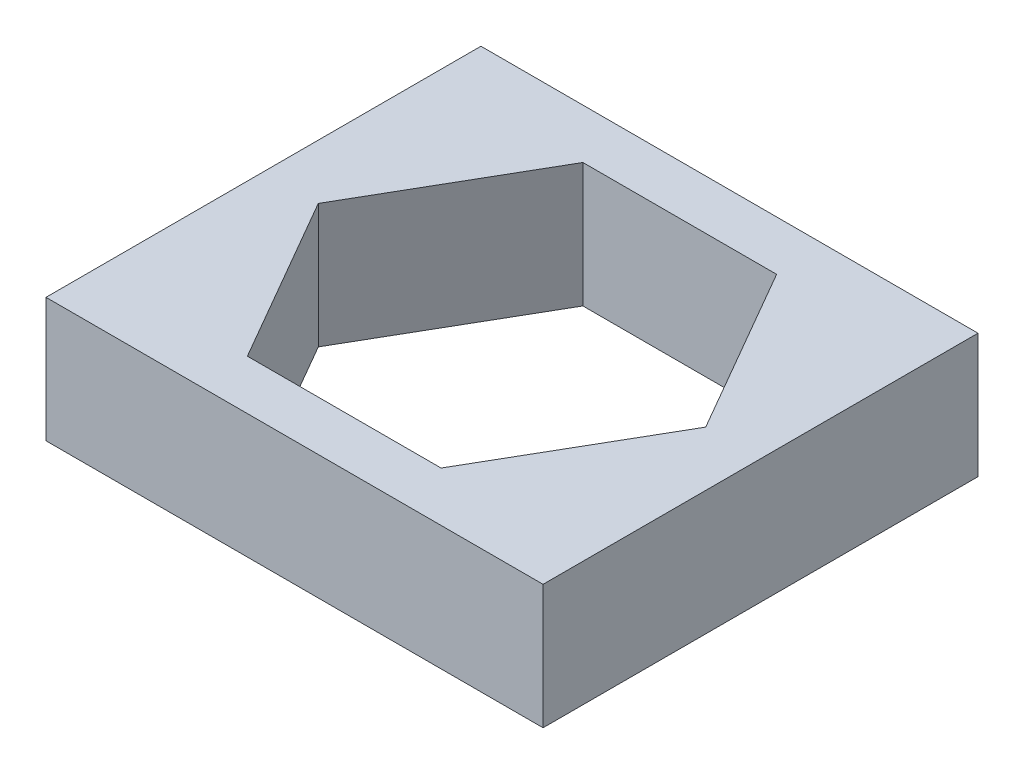
ISO-10303-21;
HEADER;
FILE_DESCRIPTION(('STEP AP214'),'2;1');
FILE_NAME('part.step','',(''),(''),'','','');
FILE_SCHEMA(('AUTOMOTIVE_DESIGN { 1 0 10303 214 1 1 1 1 }'));
ENDSEC;
DATA;
#1=APPLICATION_CONTEXT('core data for automotive mechanical design processes');
#2=APPLICATION_PROTOCOL_DEFINITION('international standard','automotive_design',2000,#1);
#3=PRODUCT_CONTEXT('',#1,'mechanical');
#4=PRODUCT('Part','Part','',(#3));
#5=PRODUCT_RELATED_PRODUCT_CATEGORY('part','',(#4));
#6=PRODUCT_DEFINITION_FORMATION('','',#4);
#7=PRODUCT_DEFINITION_CONTEXT('part definition',#1,'design');
#8=PRODUCT_DEFINITION('design','',#6,#7);
#9=PRODUCT_DEFINITION_SHAPE('','',#8);
#10=(LENGTH_UNIT() NAMED_UNIT(*) SI_UNIT(.MILLI.,.METRE.));
#11=(NAMED_UNIT(*) PLANE_ANGLE_UNIT() SI_UNIT($,.RADIAN.));
#12=(NAMED_UNIT(*) SI_UNIT($,.STERADIAN.) SOLID_ANGLE_UNIT());
#13=UNCERTAINTY_MEASURE_WITH_UNIT(LENGTH_MEASURE(1.E-05),#10,'distance_accuracy_value','');
#14=(GEOMETRIC_REPRESENTATION_CONTEXT(3) GLOBAL_UNCERTAINTY_ASSIGNED_CONTEXT((#13)) GLOBAL_UNIT_ASSIGNED_CONTEXT((#10,
#11,#12)) REPRESENTATION_CONTEXT('',''));
#15=CARTESIAN_POINT('',(0.,0.,0.));
#16=DIRECTION('',(0.,0.,1.));
#17=DIRECTION('',(1.,0.,0.));
#18=AXIS2_PLACEMENT_3D('',#15,#16,#17);
#19=CARTESIAN_POINT('',(0.,2.,0.));
#20=DIRECTION('',(0.,-1.,0.));
#21=DIRECTION('',(0.,0.,-1.));
#22=AXIS2_PLACEMENT_3D('',#19,#20,#21);
#23=PLANE('',#22);
#24=DIRECTION('',(0.,0.,1.));
#25=VECTOR('',#24,1.);
#26=CARTESIAN_POINT('',(0.,2.,0.));
#27=LINE('',#26,#25);
#28=CARTESIAN_POINT('',(0.,2.,-7.));
#29=VERTEX_POINT('',#28);
#30=CARTESIAN_POINT('',(0.,2.,0.));
#31=VERTEX_POINT('',#30);
#32=EDGE_CURVE('E171',#29,#31,#27,.T.);
#33=ORIENTED_EDGE('',*,*,#32,.T.);
#34=DIRECTION('',(1.,0.,0.));
#35=VECTOR('',#34,1.);
#36=CARTESIAN_POINT('',(0.,2.,0.));
#37=LINE('',#36,#35);
#38=CARTESIAN_POINT('',(8.,2.,0.));
#39=VERTEX_POINT('',#38);
#40=EDGE_CURVE('E174',#31,#39,#37,.T.);
#41=ORIENTED_EDGE('',*,*,#40,.T.);
#42=DIRECTION('',(0.,0.,-1.));
#43=VECTOR('',#42,1.);
#44=CARTESIAN_POINT('',(8.,2.,0.));
#45=LINE('',#44,#43);
#46=CARTESIAN_POINT('',(8.,2.,-7.));
#47=VERTEX_POINT('',#46);
#48=EDGE_CURVE('E177',#39,#47,#45,.T.);
#49=ORIENTED_EDGE('',*,*,#48,.T.);
#50=DIRECTION('',(-1.,0.,0.));
#51=VECTOR('',#50,1.);
#52=CARTESIAN_POINT('',(0.,2.,-7.));
#53=LINE('',#52,#51);
#54=EDGE_CURVE('E179',#47,#29,#53,.T.);
#55=ORIENTED_EDGE('',*,*,#54,.T.);
#56=EDGE_LOOP('',(#33,#41,#49,#55));
#57=FACE_BOUND('',#56,.T.);
#58=DIRECTION('',(0.5,0.,-0.866025403784439));
#59=VECTOR('',#58,1.);
#60=CARTESIAN_POINT('',(5.55884572681199,2.,-0.799999999999994));
#61=LINE('',#60,#59);
#62=CARTESIAN_POINT('',(5.55884572681199,2.,-0.799999999999994));
#63=VERTEX_POINT('',#62);
#64=CARTESIAN_POINT('',(7.11769145362398,2.,-3.5));
#65=VERTEX_POINT('',#64);
#66=EDGE_CURVE('E120',#63,#65,#61,.T.);
#67=ORIENTED_EDGE('',*,*,#66,.F.);
#68=DIRECTION('',(1.,0.,0.));
#69=VECTOR('',#68,1.);
#70=CARTESIAN_POINT('',(2.44115427318801,2.,-0.799999999999995));
#71=LINE('',#70,#69);
#72=CARTESIAN_POINT('',(2.44115427318801,2.,-0.799999999999995));
#73=VERTEX_POINT('',#72);
#74=EDGE_CURVE('E149',#73,#63,#71,.T.);
#75=ORIENTED_EDGE('',*,*,#74,.F.);
#76=DIRECTION('',(0.5,0.,0.866025403784438));
#77=VECTOR('',#76,1.);
#78=CARTESIAN_POINT('',(0.882308546376014,2.,-3.5));
#79=LINE('',#78,#77);
#80=CARTESIAN_POINT('',(0.882308546376014,2.,-3.5));
#81=VERTEX_POINT('',#80);
#82=EDGE_CURVE('E147',#81,#73,#79,.T.);
#83=ORIENTED_EDGE('',*,*,#82,.F.);
#84=DIRECTION('',(-0.5,0.,0.866025403784439));
#85=VECTOR('',#84,1.);
#86=CARTESIAN_POINT('',(2.44115427318801,2.,-6.20000000000001));
#87=LINE('',#86,#85);
#88=CARTESIAN_POINT('',(2.44115427318801,2.,-6.20000000000001));
#89=VERTEX_POINT('',#88);
#90=EDGE_CURVE('E143',#89,#81,#87,.T.);
#91=ORIENTED_EDGE('',*,*,#90,.F.);
#92=DIRECTION('',(-1.,0.,0.));
#93=VECTOR('',#92,1.);
#94=CARTESIAN_POINT('',(5.55884572681199,2.,-6.20000000000001));
#95=LINE('',#94,#93);
#96=CARTESIAN_POINT('',(5.55884572681199,2.,-6.20000000000001));
#97=VERTEX_POINT('',#96);
#98=EDGE_CURVE('E141',#97,#89,#95,.T.);
#99=ORIENTED_EDGE('',*,*,#98,.F.);
#100=DIRECTION('',(-0.5,0.,-0.866025403784439));
#101=VECTOR('',#100,1.);
#102=CARTESIAN_POINT('',(7.11769145362398,2.,-3.5));
#103=LINE('',#102,#101);
#104=EDGE_CURVE('E128',#65,#97,#103,.T.);
#105=ORIENTED_EDGE('',*,*,#104,.F.);
#106=EDGE_LOOP('',(#67,#75,#83,#91,#99,#105));
#107=FACE_BOUND('',#106,.T.);
#108=ADVANCED_FACE('F43',(#57,#107),#23,.F.);
#109=CARTESIAN_POINT('',(0.,0.,0.));
#110=DIRECTION('',(0.,-1.,0.));
#111=DIRECTION('',(0.,0.,-1.));
#112=AXIS2_PLACEMENT_3D('',#109,#110,#111);
#113=PLANE('',#112);
#114=DIRECTION('',(0.,0.,1.));
#115=VECTOR('',#114,1.);
#116=CARTESIAN_POINT('',(0.,0.,0.));
#117=LINE('',#116,#115);
#118=CARTESIAN_POINT('',(0.,0.,-7.));
#119=VERTEX_POINT('',#118);
#120=CARTESIAN_POINT('',(0.,0.,0.));
#121=VERTEX_POINT('',#120);
#122=EDGE_CURVE('E136',#119,#121,#117,.T.);
#123=ORIENTED_EDGE('',*,*,#122,.F.);
#124=DIRECTION('',(-1.,0.,0.));
#125=VECTOR('',#124,1.);
#126=CARTESIAN_POINT('',(0.,0.,-7.));
#127=LINE('',#126,#125);
#128=CARTESIAN_POINT('',(8.,0.,-7.));
#129=VERTEX_POINT('',#128);
#130=EDGE_CURVE('E175',#129,#119,#127,.T.);
#131=ORIENTED_EDGE('',*,*,#130,.F.);
#132=DIRECTION('',(0.,0.,-1.));
#133=VECTOR('',#132,1.);
#134=CARTESIAN_POINT('',(8.,0.,0.));
#135=LINE('',#134,#133);
#136=CARTESIAN_POINT('',(8.,0.,0.));
#137=VERTEX_POINT('',#136);
#138=EDGE_CURVE('E186',#137,#129,#135,.T.);
#139=ORIENTED_EDGE('',*,*,#138,.F.);
#140=DIRECTION('',(1.,0.,0.));
#141=VECTOR('',#140,1.);
#142=CARTESIAN_POINT('',(0.,0.,0.));
#143=LINE('',#142,#141);
#144=EDGE_CURVE('E184',#121,#137,#143,.T.);
#145=ORIENTED_EDGE('',*,*,#144,.F.);
#146=EDGE_LOOP('',(#123,#131,#139,#145));
#147=FACE_BOUND('',#146,.T.);
#148=DIRECTION('',(1.,0.,0.));
#149=VECTOR('',#148,1.);
#150=CARTESIAN_POINT('',(2.44115427318801,0.,-0.799999999999995));
#151=LINE('',#150,#149);
#152=CARTESIAN_POINT('',(2.44115427318801,0.,-0.799999999999995));
#153=VERTEX_POINT('',#152);
#154=CARTESIAN_POINT('',(5.55884572681199,0.,-0.799999999999994));
#155=VERTEX_POINT('',#154);
#156=EDGE_CURVE('E129',#153,#155,#151,.T.);
#157=ORIENTED_EDGE('',*,*,#156,.T.);
#158=DIRECTION('',(0.5,0.,-0.866025403784439));
#159=VECTOR('',#158,1.);
#160=CARTESIAN_POINT('',(5.55884572681199,0.,-0.799999999999994));
#161=LINE('',#160,#159);
#162=CARTESIAN_POINT('',(7.11769145362398,0.,-3.5));
#163=VERTEX_POINT('',#162);
#164=EDGE_CURVE('E66',#155,#163,#161,.T.);
#165=ORIENTED_EDGE('',*,*,#164,.T.);
#166=DIRECTION('',(-0.5,0.,-0.866025403784439));
#167=VECTOR('',#166,1.);
#168=CARTESIAN_POINT('',(7.11769145362398,0.,-3.5));
#169=LINE('',#168,#167);
#170=CARTESIAN_POINT('',(5.55884572681199,0.,-6.20000000000001));
#171=VERTEX_POINT('',#170);
#172=EDGE_CURVE('E135',#163,#171,#169,.T.);
#173=ORIENTED_EDGE('',*,*,#172,.T.);
#174=DIRECTION('',(-1.,0.,0.));
#175=VECTOR('',#174,1.);
#176=CARTESIAN_POINT('',(5.55884572681199,0.,-6.20000000000001));
#177=LINE('',#176,#175);
#178=CARTESIAN_POINT('',(2.44115427318801,0.,-6.20000000000001));
#179=VERTEX_POINT('',#178);
#180=EDGE_CURVE('E153',#171,#179,#177,.T.);
#181=ORIENTED_EDGE('',*,*,#180,.T.);
#182=DIRECTION('',(-0.5,0.,0.866025403784439));
#183=VECTOR('',#182,1.);
#184=CARTESIAN_POINT('',(2.44115427318801,0.,-6.20000000000001));
#185=LINE('',#184,#183);
#186=CARTESIAN_POINT('',(0.882308546376014,0.,-3.5));
#187=VERTEX_POINT('',#186);
#188=EDGE_CURVE('E156',#179,#187,#185,.T.);
#189=ORIENTED_EDGE('',*,*,#188,.T.);
#190=DIRECTION('',(0.5,0.,0.866025403784438));
#191=VECTOR('',#190,1.);
#192=CARTESIAN_POINT('',(0.882308546376014,0.,-3.5));
#193=LINE('',#192,#191);
#194=EDGE_CURVE('E159',#187,#153,#193,.T.);
#195=ORIENTED_EDGE('',*,*,#194,.T.);
#196=EDGE_LOOP('',(#157,#165,#173,#181,#189,#195));
#197=FACE_BOUND('',#196,.T.);
#198=ADVANCED_FACE('F204',(#147,#197),#113,.T.);
#199=CARTESIAN_POINT('',(0.,2.,0.));
#200=DIRECTION('',(1.,0.,0.));
#201=DIRECTION('',(0.,0.,-1.));
#202=AXIS2_PLACEMENT_3D('',#199,#200,#201);
#203=PLANE('',#202);
#204=ORIENTED_EDGE('',*,*,#122,.T.);
#205=DIRECTION('',(0.,-1.,0.));
#206=VECTOR('',#205,1.);
#207=CARTESIAN_POINT('',(0.,2.,0.));
#208=LINE('',#207,#206);
#209=EDGE_CURVE('E11',#31,#121,#208,.T.);
#210=ORIENTED_EDGE('',*,*,#209,.F.);
#211=ORIENTED_EDGE('',*,*,#32,.F.);
#212=DIRECTION('',(0.,-1.,0.));
#213=VECTOR('',#212,1.);
#214=CARTESIAN_POINT('',(0.,2.,-7.));
#215=LINE('',#214,#213);
#216=EDGE_CURVE('E181',#29,#119,#215,.T.);
#217=ORIENTED_EDGE('',*,*,#216,.T.);
#218=EDGE_LOOP('',(#204,#210,#211,#217));
#219=FACE_BOUND('',#218,.T.);
#220=ADVANCED_FACE('F45',(#219),#203,.F.);
#221=CARTESIAN_POINT('',(0.,2.,0.));
#222=DIRECTION('',(0.,0.,-1.));
#223=DIRECTION('',(-1.,0.,0.));
#224=AXIS2_PLACEMENT_3D('',#221,#222,#223);
#225=PLANE('',#224);
#226=ORIENTED_EDGE('',*,*,#144,.T.);
#227=DIRECTION('',(0.,-1.,0.));
#228=VECTOR('',#227,1.);
#229=CARTESIAN_POINT('',(8.,2.,0.));
#230=LINE('',#229,#228);
#231=EDGE_CURVE('E51',#39,#137,#230,.T.);
#232=ORIENTED_EDGE('',*,*,#231,.F.);
#233=ORIENTED_EDGE('',*,*,#40,.F.);
#234=ORIENTED_EDGE('',*,*,#209,.T.);
#235=EDGE_LOOP('',(#226,#232,#233,#234));
#236=FACE_BOUND('',#235,.T.);
#237=ADVANCED_FACE('F214',(#236),#225,.F.);
#238=CARTESIAN_POINT('',(8.,2.,0.));
#239=DIRECTION('',(-1.,0.,0.));
#240=DIRECTION('',(0.,0.,1.));
#241=AXIS2_PLACEMENT_3D('',#238,#239,#240);
#242=PLANE('',#241);
#243=ORIENTED_EDGE('',*,*,#138,.T.);
#244=DIRECTION('',(0.,-1.,0.));
#245=VECTOR('',#244,1.);
#246=CARTESIAN_POINT('',(8.,2.,-7.));
#247=LINE('',#246,#245);
#248=EDGE_CURVE('E191',#47,#129,#247,.T.);
#249=ORIENTED_EDGE('',*,*,#248,.F.);
#250=ORIENTED_EDGE('',*,*,#48,.F.);
#251=ORIENTED_EDGE('',*,*,#231,.T.);
#252=EDGE_LOOP('',(#243,#249,#250,#251));
#253=FACE_BOUND('',#252,.T.);
#254=ADVANCED_FACE('F198',(#253),#242,.F.);
#255=CARTESIAN_POINT('',(0.,2.,-7.));
#256=DIRECTION('',(0.,0.,1.));
#257=DIRECTION('',(1.,0.,0.));
#258=AXIS2_PLACEMENT_3D('',#255,#256,#257);
#259=PLANE('',#258);
#260=ORIENTED_EDGE('',*,*,#130,.T.);
#261=ORIENTED_EDGE('',*,*,#216,.F.);
#262=ORIENTED_EDGE('',*,*,#54,.F.);
#263=ORIENTED_EDGE('',*,*,#248,.T.);
#264=EDGE_LOOP('',(#260,#261,#262,#263));
#265=FACE_BOUND('',#264,.T.);
#266=ADVANCED_FACE('F208',(#265),#259,.F.);
#267=CARTESIAN_POINT('',(5.55884572681199,2.,-0.799999999999994));
#268=DIRECTION('',(-0.866025403784439,0.,-0.5));
#269=DIRECTION('',(-0.5,0.,0.866025403784439));
#270=AXIS2_PLACEMENT_3D('',#267,#268,#269);
#271=PLANE('',#270);
#272=ORIENTED_EDGE('',*,*,#164,.F.);
#273=DIRECTION('',(0.,-1.,0.));
#274=VECTOR('',#273,1.);
#275=CARTESIAN_POINT('',(5.55884572681199,2.,-0.799999999999994));
#276=LINE('',#275,#274);
#277=EDGE_CURVE('E124',#63,#155,#276,.T.);
#278=ORIENTED_EDGE('',*,*,#277,.F.);
#279=ORIENTED_EDGE('',*,*,#66,.T.);
#280=DIRECTION('',(0.,-1.,0.));
#281=VECTOR('',#280,1.);
#282=CARTESIAN_POINT('',(7.11769145362398,2.,-3.5));
#283=LINE('',#282,#281);
#284=EDGE_CURVE('E123',#65,#163,#283,.T.);
#285=ORIENTED_EDGE('',*,*,#284,.T.);
#286=EDGE_LOOP('',(#272,#278,#279,#285));
#287=FACE_BOUND('',#286,.T.);
#288=ADVANCED_FACE('F122',(#287),#271,.T.);
#289=CARTESIAN_POINT('',(7.11769145362398,2.,-3.5));
#290=DIRECTION('',(-0.866025403784439,0.,0.5));
#291=DIRECTION('',(0.5,0.,0.866025403784439));
#292=AXIS2_PLACEMENT_3D('',#289,#290,#291);
#293=PLANE('',#292);
#294=ORIENTED_EDGE('',*,*,#172,.F.);
#295=ORIENTED_EDGE('',*,*,#284,.F.);
#296=ORIENTED_EDGE('',*,*,#104,.T.);
#297=DIRECTION('',(0.,-1.,0.));
#298=VECTOR('',#297,1.);
#299=CARTESIAN_POINT('',(5.55884572681199,2.,-6.20000000000001));
#300=LINE('',#299,#298);
#301=EDGE_CURVE('E137',#97,#171,#300,.T.);
#302=ORIENTED_EDGE('',*,*,#301,.T.);
#303=EDGE_LOOP('',(#294,#295,#296,#302));
#304=FACE_BOUND('',#303,.T.);
#305=ADVANCED_FACE('F132',(#304),#293,.T.);
#306=CARTESIAN_POINT('',(5.55884572681199,2.,-6.20000000000001));
#307=DIRECTION('',(0.,0.,1.));
#308=DIRECTION('',(1.,0.,0.));
#309=AXIS2_PLACEMENT_3D('',#306,#307,#308);
#310=PLANE('',#309);
#311=ORIENTED_EDGE('',*,*,#180,.F.);
#312=ORIENTED_EDGE('',*,*,#301,.F.);
#313=ORIENTED_EDGE('',*,*,#98,.T.);
#314=DIRECTION('',(0.,-1.,0.));
#315=VECTOR('',#314,1.);
#316=CARTESIAN_POINT('',(2.44115427318801,2.,-6.20000000000001));
#317=LINE('',#316,#315);
#318=EDGE_CURVE('E168',#89,#179,#317,.T.);
#319=ORIENTED_EDGE('',*,*,#318,.T.);
#320=EDGE_LOOP('',(#311,#312,#313,#319));
#321=FACE_BOUND('',#320,.T.);
#322=ADVANCED_FACE('F237',(#321),#310,.T.);
#323=CARTESIAN_POINT('',(2.44115427318801,2.,-6.20000000000001));
#324=DIRECTION('',(0.866025403784439,0.,0.5));
#325=DIRECTION('',(0.5,0.,-0.866025403784439));
#326=AXIS2_PLACEMENT_3D('',#323,#324,#325);
#327=PLANE('',#326);
#328=ORIENTED_EDGE('',*,*,#188,.F.);
#329=ORIENTED_EDGE('',*,*,#318,.F.);
#330=ORIENTED_EDGE('',*,*,#90,.T.);
#331=DIRECTION('',(0.,-1.,0.));
#332=VECTOR('',#331,1.);
#333=CARTESIAN_POINT('',(0.882308546376014,2.,-3.5));
#334=LINE('',#333,#332);
#335=EDGE_CURVE('E166',#81,#187,#334,.T.);
#336=ORIENTED_EDGE('',*,*,#335,.T.);
#337=EDGE_LOOP('',(#328,#329,#330,#336));
#338=FACE_BOUND('',#337,.T.);
#339=ADVANCED_FACE('F241',(#338),#327,.T.);
#340=CARTESIAN_POINT('',(0.882308546376014,2.,-3.5));
#341=DIRECTION('',(0.866025403784439,0.,-0.5));
#342=DIRECTION('',(-0.5,0.,-0.866025403784438));
#343=AXIS2_PLACEMENT_3D('',#340,#341,#342);
#344=PLANE('',#343);
#345=ORIENTED_EDGE('',*,*,#194,.F.);
#346=ORIENTED_EDGE('',*,*,#335,.F.);
#347=ORIENTED_EDGE('',*,*,#82,.T.);
#348=DIRECTION('',(0.,-1.,0.));
#349=VECTOR('',#348,1.);
#350=CARTESIAN_POINT('',(2.44115427318801,2.,-0.799999999999995));
#351=LINE('',#350,#349);
#352=EDGE_CURVE('E58',#73,#153,#351,.T.);
#353=ORIENTED_EDGE('',*,*,#352,.T.);
#354=EDGE_LOOP('',(#345,#346,#347,#353));
#355=FACE_BOUND('',#354,.T.);
#356=ADVANCED_FACE('F247',(#355),#344,.T.);
#357=CARTESIAN_POINT('',(2.44115427318801,2.,-0.799999999999995));
#358=DIRECTION('',(0.,0.,-1.));
#359=DIRECTION('',(-1.,0.,0.));
#360=AXIS2_PLACEMENT_3D('',#357,#358,#359);
#361=PLANE('',#360);
#362=ORIENTED_EDGE('',*,*,#156,.F.);
#363=ORIENTED_EDGE('',*,*,#352,.F.);
#364=ORIENTED_EDGE('',*,*,#74,.T.);
#365=ORIENTED_EDGE('',*,*,#277,.T.);
#366=EDGE_LOOP('',(#362,#363,#364,#365));
#367=FACE_BOUND('',#366,.T.);
#368=ADVANCED_FACE('F251',(#367),#361,.T.);
#369=CLOSED_SHELL('',(#108,#198,#220,#237,#254,#266,#288,#305,#322,#339,#356,#368));
#370=MANIFOLD_SOLID_BREP('B2',#369);
#371=ADVANCED_BREP_SHAPE_REPRESENTATION('',(#18,#370),#14);
#372=SHAPE_DEFINITION_REPRESENTATION(#9,#371);
ENDSEC;
END-ISO-10303-21;
